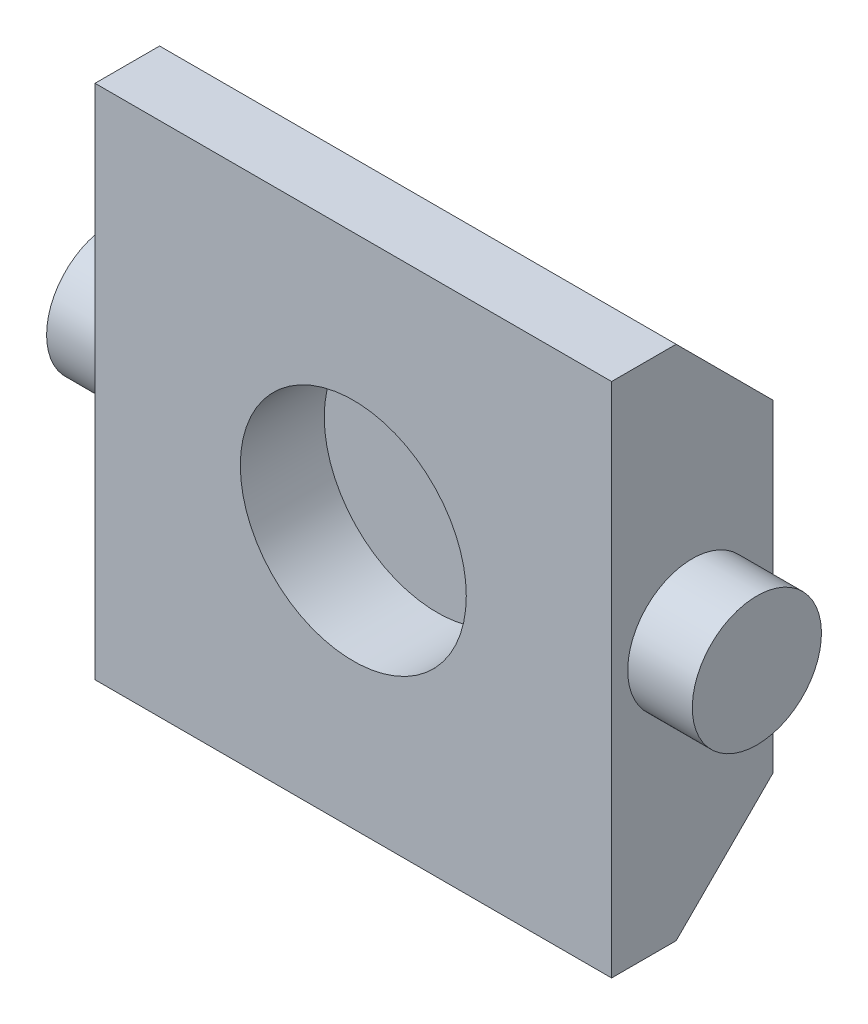
ISO-10303-21;
HEADER;
FILE_DESCRIPTION(('STEP AP214'),'2;1');
FILE_NAME('part.step','',(''),(''),'','','');
FILE_SCHEMA(('AUTOMOTIVE_DESIGN { 1 0 10303 214 1 1 1 1 }'));
ENDSEC;
DATA;
#1=APPLICATION_CONTEXT('core data for automotive mechanical design processes');
#2=APPLICATION_PROTOCOL_DEFINITION('international standard','automotive_design',2000,#1);
#3=PRODUCT_CONTEXT('',#1,'mechanical');
#4=PRODUCT('Part','Part','',(#3));
#5=PRODUCT_RELATED_PRODUCT_CATEGORY('part','',(#4));
#6=PRODUCT_DEFINITION_FORMATION('','',#4);
#7=PRODUCT_DEFINITION_CONTEXT('part definition',#1,'design');
#8=PRODUCT_DEFINITION('design','',#6,#7);
#9=PRODUCT_DEFINITION_SHAPE('','',#8);
#10=(LENGTH_UNIT() NAMED_UNIT(*) SI_UNIT(.MILLI.,.METRE.));
#11=(NAMED_UNIT(*) PLANE_ANGLE_UNIT() SI_UNIT($,.RADIAN.));
#12=(NAMED_UNIT(*) SI_UNIT($,.STERADIAN.) SOLID_ANGLE_UNIT());
#13=UNCERTAINTY_MEASURE_WITH_UNIT(LENGTH_MEASURE(1.E-05),#10,'distance_accuracy_value','');
#14=(GEOMETRIC_REPRESENTATION_CONTEXT(3) GLOBAL_UNCERTAINTY_ASSIGNED_CONTEXT((#13)) GLOBAL_UNIT_ASSIGNED_CONTEXT((#10,
#11,#12)) REPRESENTATION_CONTEXT('',''));
#15=CARTESIAN_POINT('',(0.,0.,0.));
#16=DIRECTION('',(0.,0.,1.));
#17=DIRECTION('',(1.,0.,0.));
#18=AXIS2_PLACEMENT_3D('',#15,#16,#17);
#19=CARTESIAN_POINT('',(-25.4,25.4,7.9375));
#20=DIRECTION('',(1.,0.,0.));
#21=DIRECTION('',(0.,1.,0.));
#22=AXIS2_PLACEMENT_3D('',#19,#20,#21);
#23=PLANE('',#22);
#24=DIRECTION('',(0.,0.,-1.));
#25=VECTOR('',#24,1.);
#26=CARTESIAN_POINT('',(-25.4,25.4,7.9375));
#27=LINE('',#26,#25);
#28=CARTESIAN_POINT('',(-25.4,25.4,7.9375));
#29=VERTEX_POINT('',#28);
#30=CARTESIAN_POINT('',(-25.4,25.4,1.5875));
#31=VERTEX_POINT('',#30);
#32=EDGE_CURVE('E152',#29,#31,#27,.T.);
#33=ORIENTED_EDGE('',*,*,#32,.T.);
#34=DIRECTION('',(0.,0.707106781186549,0.707106781186546));
#35=VECTOR('',#34,1.);
#36=CARTESIAN_POINT('',(-25.4,25.4,1.5875));
#37=LINE('',#36,#35);
#38=CARTESIAN_POINT('',(-25.4,15.875,-7.9375));
#39=VERTEX_POINT('',#38);
#40=EDGE_CURVE('E138',#31,#39,#37,.F.);
#41=ORIENTED_EDGE('',*,*,#40,.T.);
#42=DIRECTION('',(0.,-1.,0.));
#43=VECTOR('',#42,1.);
#44=CARTESIAN_POINT('',(-25.4,25.4,-7.9375));
#45=LINE('',#44,#43);
#46=CARTESIAN_POINT('',(-25.4,-15.875,-7.9375));
#47=VERTEX_POINT('',#46);
#48=EDGE_CURVE('E154',#39,#47,#45,.T.);
#49=ORIENTED_EDGE('',*,*,#48,.T.);
#50=DIRECTION('',(0.,0.707106781186549,-0.707106781186546));
#51=VECTOR('',#50,1.);
#52=CARTESIAN_POINT('',(-25.4,-25.4,1.5875));
#53=LINE('',#52,#51);
#54=CARTESIAN_POINT('',(-25.4,-25.4,1.5875));
#55=VERTEX_POINT('',#54);
#56=EDGE_CURVE('E125',#47,#55,#53,.F.);
#57=ORIENTED_EDGE('',*,*,#56,.T.);
#58=DIRECTION('',(0.,0.,-1.));
#59=VECTOR('',#58,1.);
#60=CARTESIAN_POINT('',(-25.4,-25.4,7.9375));
#61=LINE('',#60,#59);
#62=CARTESIAN_POINT('',(-25.4,-25.4,7.9375));
#63=VERTEX_POINT('',#62);
#64=EDGE_CURVE('E105',#63,#55,#61,.T.);
#65=ORIENTED_EDGE('',*,*,#64,.F.);
#66=DIRECTION('',(0.,-1.,0.));
#67=VECTOR('',#66,1.);
#68=CARTESIAN_POINT('',(-25.4,25.4,7.9375));
#69=LINE('',#68,#67);
#70=EDGE_CURVE('E111',#29,#63,#69,.T.);
#71=ORIENTED_EDGE('',*,*,#70,.F.);
#72=EDGE_LOOP('',(#33,#41,#49,#57,#65,#71));
#73=FACE_BOUND('',#72,.T.);
#74=CARTESIAN_POINT('',(-25.4,0.,0.));
#75=DIRECTION('',(1.,0.,0.));
#76=DIRECTION('',(0.,1.,0.));
#77=AXIS2_PLACEMENT_3D('',#74,#75,#76);
#78=CIRCLE('',#77,6.35000000000001);
#79=CARTESIAN_POINT('',(-25.4,6.35,0.));
#80=VERTEX_POINT('',#79);
#81=EDGE_CURVE('E126',#80,#80,#78,.F.);
#82=ORIENTED_EDGE('',*,*,#81,.F.);
#83=EDGE_LOOP('',(#82));
#84=FACE_BOUND('',#83,.T.);
#85=ADVANCED_FACE('F46',(#73,#84),#23,.F.);
#86=CARTESIAN_POINT('',(-25.4,-25.4,7.9375));
#87=DIRECTION('',(0.,1.,0.));
#88=DIRECTION('',(0.,0.,1.));
#89=AXIS2_PLACEMENT_3D('',#86,#87,#88);
#90=PLANE('',#89);
#91=ORIENTED_EDGE('',*,*,#64,.T.);
#92=DIRECTION('',(1.,0.,0.));
#93=VECTOR('',#92,1.);
#94=CARTESIAN_POINT('',(-25.4,-25.4,1.5875));
#95=LINE('',#94,#93);
#96=CARTESIAN_POINT('',(25.4,-25.4,1.5875));
#97=VERTEX_POINT('',#96);
#98=EDGE_CURVE('E13',#55,#97,#95,.T.);
#99=ORIENTED_EDGE('',*,*,#98,.T.);
#100=DIRECTION('',(0.,0.,-1.));
#101=VECTOR('',#100,1.);
#102=CARTESIAN_POINT('',(25.4,-25.4,7.9375));
#103=LINE('',#102,#101);
#104=CARTESIAN_POINT('',(25.4,-25.4,7.9375));
#105=VERTEX_POINT('',#104);
#106=EDGE_CURVE('E107',#105,#97,#103,.T.);
#107=ORIENTED_EDGE('',*,*,#106,.F.);
#108=DIRECTION('',(1.,0.,0.));
#109=VECTOR('',#108,1.);
#110=CARTESIAN_POINT('',(-25.4,-25.4,7.9375));
#111=LINE('',#110,#109);
#112=EDGE_CURVE('E101',#63,#105,#111,.T.);
#113=ORIENTED_EDGE('',*,*,#112,.F.);
#114=EDGE_LOOP('',(#91,#99,#107,#113));
#115=FACE_BOUND('',#114,.T.);
#116=ADVANCED_FACE('F103',(#115),#90,.F.);
#117=CARTESIAN_POINT('',(25.4,25.4,7.9375));
#118=DIRECTION('',(-1.,0.,0.));
#119=DIRECTION('',(0.,0.,1.));
#120=AXIS2_PLACEMENT_3D('',#117,#118,#119);
#121=PLANE('',#120);
#122=CARTESIAN_POINT('',(25.4,0.,0.));
#123=DIRECTION('',(-1.,0.,0.));
#124=DIRECTION('',(0.,-1.,0.));
#125=AXIS2_PLACEMENT_3D('',#122,#123,#124);
#126=CIRCLE('',#125,6.35000000000001);
#127=CARTESIAN_POINT('',(25.4,-6.35000000000001,0.));
#128=VERTEX_POINT('',#127);
#129=EDGE_CURVE('E172',#128,#128,#126,.T.);
#130=ORIENTED_EDGE('',*,*,#129,.T.);
#131=EDGE_LOOP('',(#130));
#132=FACE_BOUND('',#131,.T.);
#133=DIRECTION('',(0.,1.,0.));
#134=VECTOR('',#133,1.);
#135=CARTESIAN_POINT('',(25.4,25.4,-7.9375));
#136=LINE('',#135,#134);
#137=CARTESIAN_POINT('',(25.4,-15.875,-7.9375));
#138=VERTEX_POINT('',#137);
#139=CARTESIAN_POINT('',(25.4,15.875,-7.9375));
#140=VERTEX_POINT('',#139);
#141=EDGE_CURVE('E120',#138,#140,#136,.T.);
#142=ORIENTED_EDGE('',*,*,#141,.T.);
#143=DIRECTION('',(0.,-0.707106781186549,-0.707106781186546));
#144=VECTOR('',#143,1.);
#145=CARTESIAN_POINT('',(25.4,25.4,1.5875));
#146=LINE('',#145,#144);
#147=CARTESIAN_POINT('',(25.4,25.4,1.5875));
#148=VERTEX_POINT('',#147);
#149=EDGE_CURVE('E54',#140,#148,#146,.F.);
#150=ORIENTED_EDGE('',*,*,#149,.T.);
#151=DIRECTION('',(0.,0.,-1.));
#152=VECTOR('',#151,1.);
#153=CARTESIAN_POINT('',(25.4,25.4,7.9375));
#154=LINE('',#153,#152);
#155=CARTESIAN_POINT('',(25.4,25.4,7.9375));
#156=VERTEX_POINT('',#155);
#157=EDGE_CURVE('E131',#156,#148,#154,.T.);
#158=ORIENTED_EDGE('',*,*,#157,.F.);
#159=DIRECTION('',(0.,1.,0.));
#160=VECTOR('',#159,1.);
#161=CARTESIAN_POINT('',(25.4,25.4,7.9375));
#162=LINE('',#161,#160);
#163=EDGE_CURVE('E110',#105,#156,#162,.T.);
#164=ORIENTED_EDGE('',*,*,#163,.F.);
#165=ORIENTED_EDGE('',*,*,#106,.T.);
#166=DIRECTION('',(0.,-0.707106781186549,0.707106781186546));
#167=VECTOR('',#166,1.);
#168=CARTESIAN_POINT('',(25.4,-25.4,1.5875));
#169=LINE('',#168,#167);
#170=EDGE_CURVE('E61',#97,#138,#169,.F.);
#171=ORIENTED_EDGE('',*,*,#170,.T.);
#172=EDGE_LOOP('',(#142,#150,#158,#164,#165,#171));
#173=FACE_BOUND('',#172,.T.);
#174=ADVANCED_FACE('F147',(#132,#173),#121,.F.);
#175=CARTESIAN_POINT('',(-25.4,25.4,7.9375));
#176=DIRECTION('',(0.,-1.,0.));
#177=DIRECTION('',(0.,0.,-1.));
#178=AXIS2_PLACEMENT_3D('',#175,#176,#177);
#179=PLANE('',#178);
#180=ORIENTED_EDGE('',*,*,#157,.T.);
#181=DIRECTION('',(-1.,0.,0.));
#182=VECTOR('',#181,1.);
#183=CARTESIAN_POINT('',(-25.4,25.4,1.5875));
#184=LINE('',#183,#182);
#185=EDGE_CURVE('E129',#148,#31,#184,.T.);
#186=ORIENTED_EDGE('',*,*,#185,.T.);
#187=ORIENTED_EDGE('',*,*,#32,.F.);
#188=DIRECTION('',(-1.,0.,0.));
#189=VECTOR('',#188,1.);
#190=CARTESIAN_POINT('',(-25.4,25.4,7.9375));
#191=LINE('',#190,#189);
#192=EDGE_CURVE('E116',#156,#29,#191,.T.);
#193=ORIENTED_EDGE('',*,*,#192,.F.);
#194=EDGE_LOOP('',(#180,#186,#187,#193));
#195=FACE_BOUND('',#194,.T.);
#196=ADVANCED_FACE('F151',(#195),#179,.F.);
#197=CARTESIAN_POINT('',(-25.4,-25.4,7.9375));
#198=DIRECTION('',(0.,0.,1.));
#199=DIRECTION('',(1.,0.,0.));
#200=AXIS2_PLACEMENT_3D('',#197,#198,#199);
#201=PLANE('',#200);
#202=CARTESIAN_POINT('',(0.,0.,7.9375));
#203=DIRECTION('',(0.,0.,1.));
#204=DIRECTION('',(1.,0.,0.));
#205=AXIS2_PLACEMENT_3D('',#202,#203,#204);
#206=CIRCLE('',#205,11.1125);
#207=CARTESIAN_POINT('',(11.1125,0.,7.9375));
#208=VERTEX_POINT('',#207);
#209=EDGE_CURVE('E160',#208,#208,#206,.T.);
#210=ORIENTED_EDGE('',*,*,#209,.F.);
#211=EDGE_LOOP('',(#210));
#212=FACE_BOUND('',#211,.T.);
#213=ORIENTED_EDGE('',*,*,#70,.T.);
#214=ORIENTED_EDGE('',*,*,#112,.T.);
#215=ORIENTED_EDGE('',*,*,#163,.T.);
#216=ORIENTED_EDGE('',*,*,#192,.T.);
#217=EDGE_LOOP('',(#213,#214,#215,#216));
#218=FACE_BOUND('',#217,.T.);
#219=ADVANCED_FACE('F114',(#212,#218),#201,.T.);
#220=CARTESIAN_POINT('',(-25.4,-25.4,-7.9375));
#221=DIRECTION('',(0.,0.,1.));
#222=DIRECTION('',(1.,0.,0.));
#223=AXIS2_PLACEMENT_3D('',#220,#221,#222);
#224=PLANE('',#223);
#225=ORIENTED_EDGE('',*,*,#48,.F.);
#226=DIRECTION('',(1.,0.,0.));
#227=VECTOR('',#226,1.);
#228=CARTESIAN_POINT('',(-25.4,15.875,-7.9375));
#229=LINE('',#228,#227);
#230=EDGE_CURVE('E68',#39,#140,#229,.T.);
#231=ORIENTED_EDGE('',*,*,#230,.T.);
#232=ORIENTED_EDGE('',*,*,#141,.F.);
#233=DIRECTION('',(-1.,0.,0.));
#234=VECTOR('',#233,1.);
#235=CARTESIAN_POINT('',(-25.4,-15.875,-7.9375));
#236=LINE('',#235,#234);
#237=EDGE_CURVE('E140',#138,#47,#236,.T.);
#238=ORIENTED_EDGE('',*,*,#237,.T.);
#239=EDGE_LOOP('',(#225,#231,#232,#238));
#240=FACE_BOUND('',#239,.T.);
#241=ADVANCED_FACE('F155',(#240),#224,.F.);
#242=CARTESIAN_POINT('',(0.,0.,-0.3175));
#243=DIRECTION('',(0.,0.,1.));
#244=DIRECTION('',(1.,0.,0.));
#245=AXIS2_PLACEMENT_3D('',#242,#243,#244);
#246=CYLINDRICAL_SURFACE('',#245,11.1125);
#247=CARTESIAN_POINT('',(0.,0.,-0.3175));
#248=DIRECTION('',(0.,0.,1.));
#249=DIRECTION('',(1.,0.,0.));
#250=AXIS2_PLACEMENT_3D('',#247,#248,#249);
#251=CIRCLE('',#250,11.1125);
#252=CARTESIAN_POINT('',(11.1125,0.,-0.3175));
#253=VERTEX_POINT('',#252);
#254=EDGE_CURVE('E156',#253,#253,#251,.T.);
#255=ORIENTED_EDGE('',*,*,#254,.F.);
#256=EDGE_LOOP('',(#255));
#257=FACE_BOUND('',#256,.T.);
#258=ORIENTED_EDGE('',*,*,#209,.T.);
#259=EDGE_LOOP('',(#258));
#260=FACE_BOUND('',#259,.T.);
#261=ADVANCED_FACE('F204',(#257,#260),#246,.F.);
#262=CARTESIAN_POINT('',(0.,0.,-0.3175));
#263=DIRECTION('',(0.,0.,1.));
#264=DIRECTION('',(1.,0.,0.));
#265=AXIS2_PLACEMENT_3D('',#262,#263,#264);
#266=PLANE('',#265);
#267=ORIENTED_EDGE('',*,*,#254,.T.);
#268=EDGE_LOOP('',(#267));
#269=FACE_BOUND('',#268,.T.);
#270=ADVANCED_FACE('F210',(#269),#266,.T.);
#271=CARTESIAN_POINT('',(-31.75,0.,0.));
#272=DIRECTION('',(1.,0.,0.));
#273=DIRECTION('',(0.,1.,0.));
#274=AXIS2_PLACEMENT_3D('',#271,#272,#273);
#275=CYLINDRICAL_SURFACE('',#274,6.35000000000001);
#276=CARTESIAN_POINT('',(-31.75,0.,0.));
#277=DIRECTION('',(-1.,0.,0.));
#278=DIRECTION('',(0.,-1.,0.));
#279=AXIS2_PLACEMENT_3D('',#276,#277,#278);
#280=CIRCLE('',#279,6.35000000000001);
#281=CARTESIAN_POINT('',(-31.75,-6.35000000000001,0.));
#282=VERTEX_POINT('',#281);
#283=EDGE_CURVE('E167',#282,#282,#280,.T.);
#284=ORIENTED_EDGE('',*,*,#283,.F.);
#285=EDGE_LOOP('',(#284));
#286=FACE_BOUND('',#285,.T.);
#287=ORIENTED_EDGE('',*,*,#81,.T.);
#288=EDGE_LOOP('',(#287));
#289=FACE_BOUND('',#288,.T.);
#290=ADVANCED_FACE('F214',(#286,#289),#275,.T.);
#291=CARTESIAN_POINT('',(-31.75,0.,0.));
#292=DIRECTION('',(-1.,0.,0.));
#293=DIRECTION('',(0.,-1.,0.));
#294=AXIS2_PLACEMENT_3D('',#291,#292,#293);
#295=PLANE('',#294);
#296=ORIENTED_EDGE('',*,*,#283,.T.);
#297=EDGE_LOOP('',(#296));
#298=FACE_BOUND('',#297,.T.);
#299=ADVANCED_FACE('F188',(#298),#295,.T.);
#300=CARTESIAN_POINT('',(31.75,0.,0.));
#301=DIRECTION('',(-1.,0.,0.));
#302=DIRECTION('',(0.,-1.,0.));
#303=AXIS2_PLACEMENT_3D('',#300,#301,#302);
#304=CYLINDRICAL_SURFACE('',#303,6.35000000000001);
#305=CARTESIAN_POINT('',(31.75,0.,0.));
#306=DIRECTION('',(-1.,0.,0.));
#307=DIRECTION('',(0.,-1.,0.));
#308=AXIS2_PLACEMENT_3D('',#305,#306,#307);
#309=CIRCLE('',#308,6.35000000000001);
#310=CARTESIAN_POINT('',(31.75,-6.35000000000001,0.));
#311=VERTEX_POINT('',#310);
#312=EDGE_CURVE('E171',#311,#311,#309,.T.);
#313=ORIENTED_EDGE('',*,*,#312,.T.);
#314=EDGE_LOOP('',(#313));
#315=FACE_BOUND('',#314,.T.);
#316=ORIENTED_EDGE('',*,*,#129,.F.);
#317=EDGE_LOOP('',(#316));
#318=FACE_BOUND('',#317,.T.);
#319=ADVANCED_FACE('F178',(#315,#318),#304,.T.);
#320=CARTESIAN_POINT('',(31.75,0.,0.));
#321=DIRECTION('',(1.,0.,0.));
#322=DIRECTION('',(0.,-1.,0.));
#323=AXIS2_PLACEMENT_3D('',#320,#321,#322);
#324=PLANE('',#323);
#325=ORIENTED_EDGE('',*,*,#312,.F.);
#326=EDGE_LOOP('',(#325));
#327=FACE_BOUND('',#326,.T.);
#328=ADVANCED_FACE('F181',(#327),#324,.T.);
#329=CARTESIAN_POINT('',(-25.4,25.4,1.5875));
#330=DIRECTION('',(0.,-0.707106781186546,0.707106781186549));
#331=DIRECTION('',(0.,-0.707106781186549,-0.707106781186546));
#332=AXIS2_PLACEMENT_3D('',#329,#330,#331);
#333=PLANE('',#332);
#334=ORIENTED_EDGE('',*,*,#149,.F.);
#335=ORIENTED_EDGE('',*,*,#230,.F.);
#336=ORIENTED_EDGE('',*,*,#40,.F.);
#337=ORIENTED_EDGE('',*,*,#185,.F.);
#338=EDGE_LOOP('',(#334,#335,#336,#337));
#339=FACE_BOUND('',#338,.T.);
#340=ADVANCED_FACE('F153',(#339),#333,.F.);
#341=CARTESIAN_POINT('',(-25.4,-25.4,1.5875));
#342=DIRECTION('',(0.,0.707106781186546,0.707106781186549));
#343=DIRECTION('',(0.,-0.707106781186549,0.707106781186546));
#344=AXIS2_PLACEMENT_3D('',#341,#342,#343);
#345=PLANE('',#344);
#346=ORIENTED_EDGE('',*,*,#56,.F.);
#347=ORIENTED_EDGE('',*,*,#237,.F.);
#348=ORIENTED_EDGE('',*,*,#170,.F.);
#349=ORIENTED_EDGE('',*,*,#98,.F.);
#350=EDGE_LOOP('',(#346,#347,#348,#349));
#351=FACE_BOUND('',#350,.T.);
#352=ADVANCED_FACE('F48',(#351),#345,.F.);
#353=CLOSED_SHELL('',(#85,#116,#174,#196,#219,#241,#261,#270,#290,#299,#319,#328,#340,#352));
#354=MANIFOLD_SOLID_BREP('B2',#353);
#355=ADVANCED_BREP_SHAPE_REPRESENTATION('',(#18,#354),#14);
#356=SHAPE_DEFINITION_REPRESENTATION(#9,#355);
ENDSEC;
END-ISO-10303-21;
